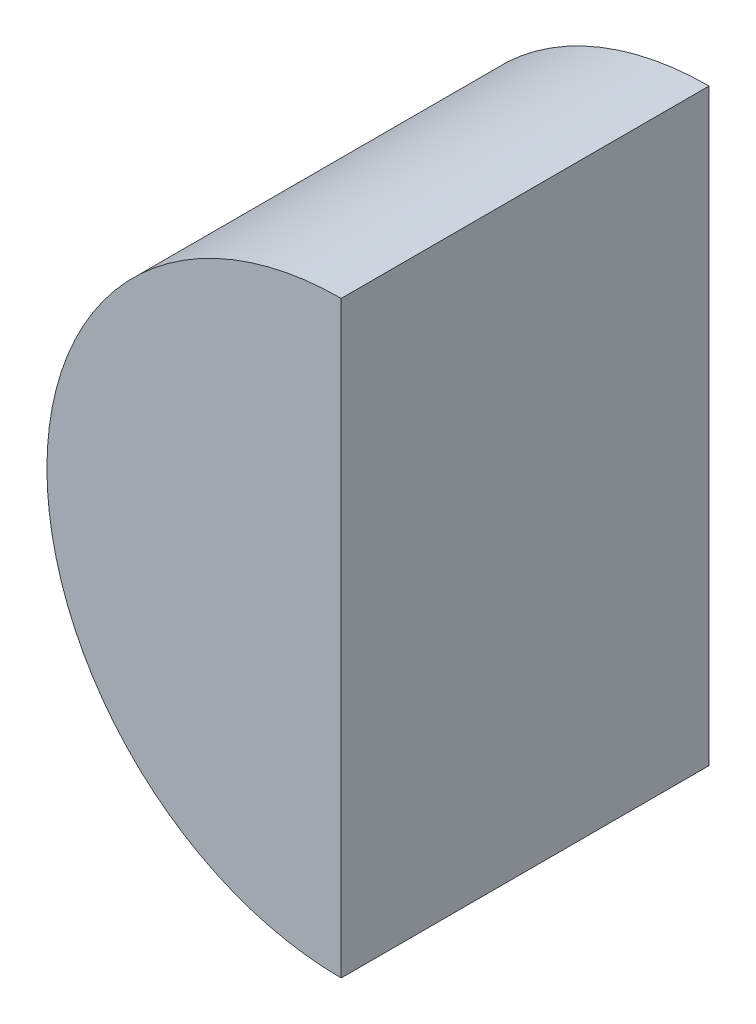
ISO-10303-21;
HEADER;
FILE_DESCRIPTION(('STEP AP214'),'2;1');
FILE_NAME('part.step','',(''),(''),'','','');
FILE_SCHEMA(('AUTOMOTIVE_DESIGN { 1 0 10303 214 1 1 1 1 }'));
ENDSEC;
DATA;
#1=APPLICATION_CONTEXT('core data for automotive mechanical design processes');
#2=APPLICATION_PROTOCOL_DEFINITION('international standard','automotive_design',2000,#1);
#3=PRODUCT_CONTEXT('',#1,'mechanical');
#4=PRODUCT('Part','Part','',(#3));
#5=PRODUCT_RELATED_PRODUCT_CATEGORY('part','',(#4));
#6=PRODUCT_DEFINITION_FORMATION('','',#4);
#7=PRODUCT_DEFINITION_CONTEXT('part definition',#1,'design');
#8=PRODUCT_DEFINITION('design','',#6,#7);
#9=PRODUCT_DEFINITION_SHAPE('','',#8);
#10=(LENGTH_UNIT() NAMED_UNIT(*) SI_UNIT(.MILLI.,.METRE.));
#11=(NAMED_UNIT(*) PLANE_ANGLE_UNIT() SI_UNIT($,.RADIAN.));
#12=(NAMED_UNIT(*) SI_UNIT($,.STERADIAN.) SOLID_ANGLE_UNIT());
#13=UNCERTAINTY_MEASURE_WITH_UNIT(LENGTH_MEASURE(1.E-05),#10,'distance_accuracy_value','');
#14=(GEOMETRIC_REPRESENTATION_CONTEXT(3) GLOBAL_UNCERTAINTY_ASSIGNED_CONTEXT((#13)) GLOBAL_UNIT_ASSIGNED_CONTEXT((#10,
#11,#12)) REPRESENTATION_CONTEXT('',''));
#15=CARTESIAN_POINT('',(0.,0.,0.));
#16=DIRECTION('',(0.,0.,1.));
#17=DIRECTION('',(1.,0.,0.));
#18=AXIS2_PLACEMENT_3D('',#15,#16,#17);
#19=CARTESIAN_POINT('',(-250.,212.5,-25.));
#20=DIRECTION('',(0.,0.,1.));
#21=DIRECTION('',(1.,0.,0.));
#22=AXIS2_PLACEMENT_3D('',#19,#20,#21);
#23=CYLINDRICAL_SURFACE('',#22,20.);
#24=CARTESIAN_POINT('',(-250.,212.5,0.));
#25=DIRECTION('',(0.,0.,1.));
#26=DIRECTION('',(1.,0.,0.));
#27=AXIS2_PLACEMENT_3D('',#24,#25,#26);
#28=CIRCLE('',#27,20.);
#29=CARTESIAN_POINT('',(-250.,232.5,0.));
#30=VERTEX_POINT('',#29);
#31=CARTESIAN_POINT('',(-250.,192.5,0.));
#32=VERTEX_POINT('',#31);
#33=EDGE_CURVE('E64',#30,#32,#28,.T.);
#34=ORIENTED_EDGE('',*,*,#33,.F.);
#35=DIRECTION('',(0.,0.,1.));
#36=VECTOR('',#35,1.);
#37=CARTESIAN_POINT('',(-250.,232.5,-25.));
#38=LINE('',#37,#36);
#39=CARTESIAN_POINT('',(-250.,232.5,-25.));
#40=VERTEX_POINT('',#39);
#41=EDGE_CURVE('E11',#40,#30,#38,.T.);
#42=ORIENTED_EDGE('',*,*,#41,.F.);
#43=CARTESIAN_POINT('',(-250.,212.5,-25.));
#44=DIRECTION('',(0.,0.,1.));
#45=DIRECTION('',(1.,0.,0.));
#46=AXIS2_PLACEMENT_3D('',#43,#44,#45);
#47=CIRCLE('',#46,20.);
#48=CARTESIAN_POINT('',(-250.,192.5,-25.));
#49=VERTEX_POINT('',#48);
#50=EDGE_CURVE('E68',#40,#49,#47,.T.);
#51=ORIENTED_EDGE('',*,*,#50,.T.);
#52=DIRECTION('',(0.,0.,1.));
#53=VECTOR('',#52,1.);
#54=CARTESIAN_POINT('',(-250.,192.5,-25.));
#55=LINE('',#54,#53);
#56=EDGE_CURVE('E38',#49,#32,#55,.T.);
#57=ORIENTED_EDGE('',*,*,#56,.T.);
#58=EDGE_LOOP('',(#34,#42,#51,#57));
#59=FACE_BOUND('',#58,.T.);
#60=ADVANCED_FACE('F35',(#59),#23,.T.);
#61=CARTESIAN_POINT('',(-250.,232.5,-25.));
#62=DIRECTION('',(1.,0.,0.));
#63=DIRECTION('',(0.,0.,-1.));
#64=AXIS2_PLACEMENT_3D('',#61,#62,#63);
#65=PLANE('',#64);
#66=DIRECTION('',(0.,1.,0.));
#67=VECTOR('',#66,1.);
#68=CARTESIAN_POINT('',(-250.,232.5,0.));
#69=LINE('',#68,#67);
#70=EDGE_CURVE('E61',#32,#30,#69,.T.);
#71=ORIENTED_EDGE('',*,*,#70,.F.);
#72=ORIENTED_EDGE('',*,*,#56,.F.);
#73=DIRECTION('',(0.,1.,0.));
#74=VECTOR('',#73,1.);
#75=CARTESIAN_POINT('',(-250.,232.5,-25.));
#76=LINE('',#75,#74);
#77=EDGE_CURVE('E63',#49,#40,#76,.T.);
#78=ORIENTED_EDGE('',*,*,#77,.T.);
#79=ORIENTED_EDGE('',*,*,#41,.T.);
#80=EDGE_LOOP('',(#71,#72,#78,#79));
#81=FACE_BOUND('',#80,.T.);
#82=ADVANCED_FACE('F59',(#81),#65,.T.);
#83=CARTESIAN_POINT('',(-250.,212.5,-25.));
#84=DIRECTION('',(0.,0.,1.));
#85=DIRECTION('',(1.,0.,0.));
#86=AXIS2_PLACEMENT_3D('',#83,#84,#85);
#87=PLANE('',#86);
#88=ORIENTED_EDGE('',*,*,#50,.F.);
#89=ORIENTED_EDGE('',*,*,#77,.F.);
#90=EDGE_LOOP('',(#88,#89));
#91=FACE_BOUND('',#90,.T.);
#92=ADVANCED_FACE('F73',(#91),#87,.F.);
#93=CARTESIAN_POINT('',(-250.,212.5,0.));
#94=DIRECTION('',(0.,0.,1.));
#95=DIRECTION('',(1.,0.,0.));
#96=AXIS2_PLACEMENT_3D('',#93,#94,#95);
#97=PLANE('',#96);
#98=ORIENTED_EDGE('',*,*,#33,.T.);
#99=ORIENTED_EDGE('',*,*,#70,.T.);
#100=EDGE_LOOP('',(#98,#99));
#101=FACE_BOUND('',#100,.T.);
#102=ADVANCED_FACE('F67',(#101),#97,.T.);
#103=CLOSED_SHELL('',(#60,#82,#92,#102));
#104=MANIFOLD_SOLID_BREP('B2',#103);
#105=ADVANCED_BREP_SHAPE_REPRESENTATION('',(#18,#104),#14);
#106=SHAPE_DEFINITION_REPRESENTATION(#9,#105);
ENDSEC;
END-ISO-10303-21;
